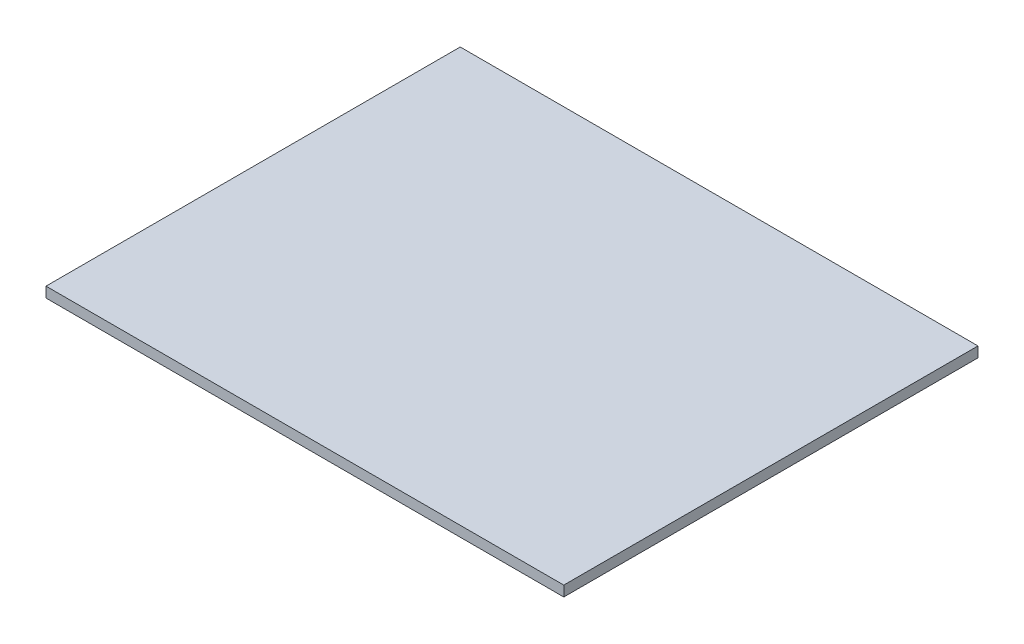
ISO-10303-21;
HEADER;
FILE_DESCRIPTION(('STEP AP214'),'2;1');
FILE_NAME('part.step','',(''),(''),'','','');
FILE_SCHEMA(('AUTOMOTIVE_DESIGN { 1 0 10303 214 1 1 1 1 }'));
ENDSEC;
DATA;
#1=APPLICATION_CONTEXT('core data for automotive mechanical design processes');
#2=APPLICATION_PROTOCOL_DEFINITION('international standard','automotive_design',2000,#1);
#3=PRODUCT_CONTEXT('',#1,'mechanical');
#4=PRODUCT('Part','Part','',(#3));
#5=PRODUCT_RELATED_PRODUCT_CATEGORY('part','',(#4));
#6=PRODUCT_DEFINITION_FORMATION('','',#4);
#7=PRODUCT_DEFINITION_CONTEXT('part definition',#1,'design');
#8=PRODUCT_DEFINITION('design','',#6,#7);
#9=PRODUCT_DEFINITION_SHAPE('','',#8);
#10=(LENGTH_UNIT() NAMED_UNIT(*) SI_UNIT(.MILLI.,.METRE.));
#11=(NAMED_UNIT(*) PLANE_ANGLE_UNIT() SI_UNIT($,.RADIAN.));
#12=(NAMED_UNIT(*) SI_UNIT($,.STERADIAN.) SOLID_ANGLE_UNIT());
#13=UNCERTAINTY_MEASURE_WITH_UNIT(LENGTH_MEASURE(1.E-05),#10,'distance_accuracy_value','');
#14=(GEOMETRIC_REPRESENTATION_CONTEXT(3) GLOBAL_UNCERTAINTY_ASSIGNED_CONTEXT((#13)) GLOBAL_UNIT_ASSIGNED_CONTEXT((#10,
#11,#12)) REPRESENTATION_CONTEXT('',''));
#15=CARTESIAN_POINT('',(0.,0.,0.));
#16=DIRECTION('',(0.,0.,1.));
#17=DIRECTION('',(1.,0.,0.));
#18=AXIS2_PLACEMENT_3D('',#15,#16,#17);
#19=CARTESIAN_POINT('',(0.,3.,120.));
#20=DIRECTION('',(1.,0.,0.));
#21=DIRECTION('',(0.,0.,-1.));
#22=AXIS2_PLACEMENT_3D('',#19,#20,#21);
#23=PLANE('',#22);
#24=DIRECTION('',(0.,0.,1.));
#25=VECTOR('',#24,1.);
#26=CARTESIAN_POINT('',(0.,0.,120.));
#27=LINE('',#26,#25);
#28=CARTESIAN_POINT('',(0.,0.,0.));
#29=VERTEX_POINT('',#28);
#30=CARTESIAN_POINT('',(0.,0.,120.));
#31=VERTEX_POINT('',#30);
#32=EDGE_CURVE('E97',#29,#31,#27,.T.);
#33=ORIENTED_EDGE('',*,*,#32,.T.);
#34=DIRECTION('',(0.,-1.,0.));
#35=VECTOR('',#34,1.);
#36=CARTESIAN_POINT('',(0.,3.,120.));
#37=LINE('',#36,#35);
#38=CARTESIAN_POINT('',(0.,3.,120.));
#39=VERTEX_POINT('',#38);
#40=EDGE_CURVE('E11',#39,#31,#37,.T.);
#41=ORIENTED_EDGE('',*,*,#40,.F.);
#42=DIRECTION('',(0.,0.,1.));
#43=VECTOR('',#42,1.);
#44=CARTESIAN_POINT('',(0.,3.,120.));
#45=LINE('',#44,#43);
#46=CARTESIAN_POINT('',(0.,3.,0.));
#47=VERTEX_POINT('',#46);
#48=EDGE_CURVE('E85',#47,#39,#45,.T.);
#49=ORIENTED_EDGE('',*,*,#48,.F.);
#50=DIRECTION('',(0.,-1.,0.));
#51=VECTOR('',#50,1.);
#52=CARTESIAN_POINT('',(0.,3.,0.));
#53=LINE('',#52,#51);
#54=EDGE_CURVE('E93',#47,#29,#53,.T.);
#55=ORIENTED_EDGE('',*,*,#54,.T.);
#56=EDGE_LOOP('',(#33,#41,#49,#55));
#57=FACE_BOUND('',#56,.T.);
#58=ADVANCED_FACE('F34',(#57),#23,.F.);
#59=CARTESIAN_POINT('',(150.,3.,120.));
#60=DIRECTION('',(0.,0.,-1.));
#61=DIRECTION('',(-1.,0.,0.));
#62=AXIS2_PLACEMENT_3D('',#59,#60,#61);
#63=PLANE('',#62);
#64=DIRECTION('',(1.,0.,0.));
#65=VECTOR('',#64,1.);
#66=CARTESIAN_POINT('',(150.,0.,120.));
#67=LINE('',#66,#65);
#68=CARTESIAN_POINT('',(150.,0.,120.));
#69=VERTEX_POINT('',#68);
#70=EDGE_CURVE('E89',#31,#69,#67,.T.);
#71=ORIENTED_EDGE('',*,*,#70,.T.);
#72=DIRECTION('',(0.,-1.,0.));
#73=VECTOR('',#72,1.);
#74=CARTESIAN_POINT('',(150.,3.,120.));
#75=LINE('',#74,#73);
#76=CARTESIAN_POINT('',(150.,3.,120.));
#77=VERTEX_POINT('',#76);
#78=EDGE_CURVE('E42',#77,#69,#75,.T.);
#79=ORIENTED_EDGE('',*,*,#78,.F.);
#80=DIRECTION('',(1.,0.,0.));
#81=VECTOR('',#80,1.);
#82=CARTESIAN_POINT('',(150.,3.,120.));
#83=LINE('',#82,#81);
#84=EDGE_CURVE('E80',#39,#77,#83,.T.);
#85=ORIENTED_EDGE('',*,*,#84,.F.);
#86=ORIENTED_EDGE('',*,*,#40,.T.);
#87=EDGE_LOOP('',(#71,#79,#85,#86));
#88=FACE_BOUND('',#87,.T.);
#89=ADVANCED_FACE('F88',(#88),#63,.F.);
#90=CARTESIAN_POINT('',(150.,3.,0.));
#91=DIRECTION('',(-1.,0.,0.));
#92=DIRECTION('',(0.,0.,1.));
#93=AXIS2_PLACEMENT_3D('',#90,#91,#92);
#94=PLANE('',#93);
#95=DIRECTION('',(0.,0.,-1.));
#96=VECTOR('',#95,1.);
#97=CARTESIAN_POINT('',(150.,0.,0.));
#98=LINE('',#97,#96);
#99=CARTESIAN_POINT('',(150.,0.,0.));
#100=VERTEX_POINT('',#99);
#101=EDGE_CURVE('E67',#69,#100,#98,.T.);
#102=ORIENTED_EDGE('',*,*,#101,.T.);
#103=DIRECTION('',(0.,-1.,0.));
#104=VECTOR('',#103,1.);
#105=CARTESIAN_POINT('',(150.,3.,0.));
#106=LINE('',#105,#104);
#107=CARTESIAN_POINT('',(150.,3.,0.));
#108=VERTEX_POINT('',#107);
#109=EDGE_CURVE('E90',#108,#100,#106,.T.);
#110=ORIENTED_EDGE('',*,*,#109,.F.);
#111=DIRECTION('',(0.,0.,-1.));
#112=VECTOR('',#111,1.);
#113=CARTESIAN_POINT('',(150.,3.,0.));
#114=LINE('',#113,#112);
#115=EDGE_CURVE('E83',#77,#108,#114,.T.);
#116=ORIENTED_EDGE('',*,*,#115,.F.);
#117=ORIENTED_EDGE('',*,*,#78,.T.);
#118=EDGE_LOOP('',(#102,#110,#116,#117));
#119=FACE_BOUND('',#118,.T.);
#120=ADVANCED_FACE('F91',(#119),#94,.F.);
#121=CARTESIAN_POINT('',(0.,3.,0.));
#122=DIRECTION('',(0.,0.,1.));
#123=DIRECTION('',(1.,0.,0.));
#124=AXIS2_PLACEMENT_3D('',#121,#122,#123);
#125=PLANE('',#124);
#126=DIRECTION('',(-1.,0.,0.));
#127=VECTOR('',#126,1.);
#128=CARTESIAN_POINT('',(0.,0.,0.));
#129=LINE('',#128,#127);
#130=EDGE_CURVE('E73',#100,#29,#129,.T.);
#131=ORIENTED_EDGE('',*,*,#130,.T.);
#132=ORIENTED_EDGE('',*,*,#54,.F.);
#133=DIRECTION('',(-1.,0.,0.));
#134=VECTOR('',#133,1.);
#135=CARTESIAN_POINT('',(0.,3.,0.));
#136=LINE('',#135,#134);
#137=EDGE_CURVE('E50',#108,#47,#136,.T.);
#138=ORIENTED_EDGE('',*,*,#137,.F.);
#139=ORIENTED_EDGE('',*,*,#109,.T.);
#140=EDGE_LOOP('',(#131,#132,#138,#139));
#141=FACE_BOUND('',#140,.T.);
#142=ADVANCED_FACE('F104',(#141),#125,.F.);
#143=CARTESIAN_POINT('',(0.,3.,0.));
#144=DIRECTION('',(0.,-1.,0.));
#145=DIRECTION('',(0.,0.,-1.));
#146=AXIS2_PLACEMENT_3D('',#143,#144,#145);
#147=PLANE('',#146);
#148=ORIENTED_EDGE('',*,*,#48,.T.);
#149=ORIENTED_EDGE('',*,*,#84,.T.);
#150=ORIENTED_EDGE('',*,*,#115,.T.);
#151=ORIENTED_EDGE('',*,*,#137,.T.);
#152=EDGE_LOOP('',(#148,#149,#150,#151));
#153=FACE_BOUND('',#152,.T.);
#154=ADVANCED_FACE('F81',(#153),#147,.F.);
#155=CARTESIAN_POINT('',(0.,0.,0.));
#156=DIRECTION('',(0.,-1.,0.));
#157=DIRECTION('',(0.,0.,-1.));
#158=AXIS2_PLACEMENT_3D('',#155,#156,#157);
#159=PLANE('',#158);
#160=ORIENTED_EDGE('',*,*,#32,.F.);
#161=ORIENTED_EDGE('',*,*,#130,.F.);
#162=ORIENTED_EDGE('',*,*,#101,.F.);
#163=ORIENTED_EDGE('',*,*,#70,.F.);
#164=EDGE_LOOP('',(#160,#161,#162,#163));
#165=FACE_BOUND('',#164,.T.);
#166=ADVANCED_FACE('F107',(#165),#159,.T.);
#167=CLOSED_SHELL('',(#58,#89,#120,#142,#154,#166));
#168=MANIFOLD_SOLID_BREP('B2',#167);
#169=ADVANCED_BREP_SHAPE_REPRESENTATION('',(#18,#168),#14);
#170=SHAPE_DEFINITION_REPRESENTATION(#9,#169);
ENDSEC;
END-ISO-10303-21;
